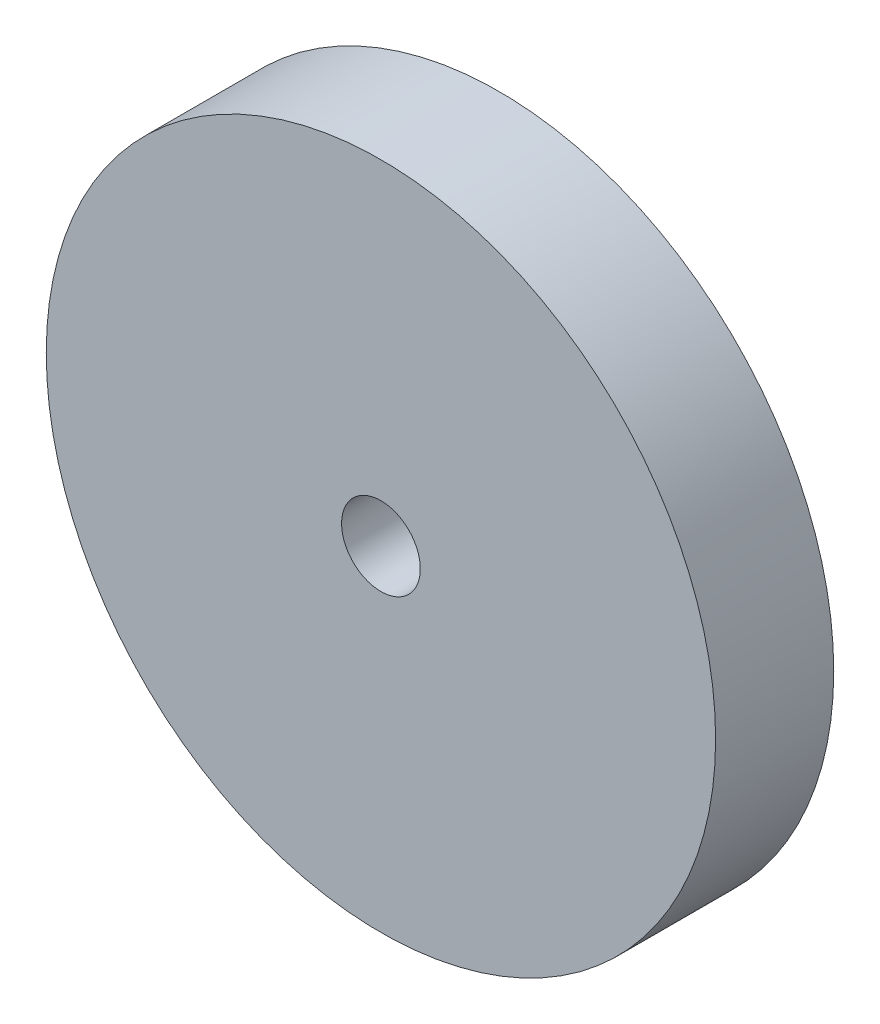
ISO-10303-21;
HEADER;
FILE_DESCRIPTION(('STEP AP214'),'2;1');
FILE_NAME('part.step','',(''),(''),'','','');
FILE_SCHEMA(('AUTOMOTIVE_DESIGN { 1 0 10303 214 1 1 1 1 }'));
ENDSEC;
DATA;
#1=APPLICATION_CONTEXT('core data for automotive mechanical design processes');
#2=APPLICATION_PROTOCOL_DEFINITION('international standard','automotive_design',2000,#1);
#3=PRODUCT_CONTEXT('',#1,'mechanical');
#4=PRODUCT('Part','Part','',(#3));
#5=PRODUCT_RELATED_PRODUCT_CATEGORY('part','',(#4));
#6=PRODUCT_DEFINITION_FORMATION('','',#4);
#7=PRODUCT_DEFINITION_CONTEXT('part definition',#1,'design');
#8=PRODUCT_DEFINITION('design','',#6,#7);
#9=PRODUCT_DEFINITION_SHAPE('','',#8);
#10=(LENGTH_UNIT() NAMED_UNIT(*) SI_UNIT(.MILLI.,.METRE.));
#11=(NAMED_UNIT(*) PLANE_ANGLE_UNIT() SI_UNIT($,.RADIAN.));
#12=(NAMED_UNIT(*) SI_UNIT($,.STERADIAN.) SOLID_ANGLE_UNIT());
#13=UNCERTAINTY_MEASURE_WITH_UNIT(LENGTH_MEASURE(1.E-05),#10,'distance_accuracy_value','');
#14=(GEOMETRIC_REPRESENTATION_CONTEXT(3) GLOBAL_UNCERTAINTY_ASSIGNED_CONTEXT((#13)) GLOBAL_UNIT_ASSIGNED_CONTEXT((#10,
#11,#12)) REPRESENTATION_CONTEXT('',''));
#15=CARTESIAN_POINT('',(0.,0.,0.));
#16=DIRECTION('',(0.,0.,1.));
#17=DIRECTION('',(1.,0.,0.));
#18=AXIS2_PLACEMENT_3D('',#15,#16,#17);
#19=CARTESIAN_POINT('',(0.,0.,0.));
#20=DIRECTION('',(0.,0.,1.));
#21=DIRECTION('',(1.,0.,0.));
#22=AXIS2_PLACEMENT_3D('',#19,#20,#21);
#23=PLANE('',#22);
#24=CARTESIAN_POINT('',(0.,0.,0.));
#25=DIRECTION('',(0.,0.,-1.));
#26=DIRECTION('',(-1.,0.,0.));
#27=AXIS2_PLACEMENT_3D('',#24,#25,#26);
#28=CIRCLE('',#27,1.);
#29=CARTESIAN_POINT('',(-1.,0.,0.));
#30=VERTEX_POINT('',#29);
#31=EDGE_CURVE('E26',#30,#30,#28,.F.);
#32=ORIENTED_EDGE('',*,*,#31,.T.);
#33=EDGE_LOOP('',(#32));
#34=FACE_BOUND('',#33,.T.);
#35=CARTESIAN_POINT('',(0.,0.,0.));
#36=DIRECTION('',(0.,0.,-1.));
#37=DIRECTION('',(-1.,0.,0.));
#38=AXIS2_PLACEMENT_3D('',#35,#36,#37);
#39=CIRCLE('',#38,8.5);
#40=CARTESIAN_POINT('',(-8.5,0.,0.));
#41=VERTEX_POINT('',#40);
#42=EDGE_CURVE('E17',#41,#41,#39,.F.);
#43=ORIENTED_EDGE('',*,*,#42,.F.);
#44=EDGE_LOOP('',(#43));
#45=FACE_BOUND('',#44,.T.);
#46=ADVANCED_FACE('F14',(#34,#45),#23,.F.);
#47=CARTESIAN_POINT('',(0.,0.,3.));
#48=DIRECTION('',(0.,0.,-1.));
#49=DIRECTION('',(-1.,0.,0.));
#50=AXIS2_PLACEMENT_3D('',#47,#48,#49);
#51=CYLINDRICAL_SURFACE('',#50,8.5);
#52=ORIENTED_EDGE('',*,*,#42,.T.);
#53=EDGE_LOOP('',(#52));
#54=FACE_BOUND('',#53,.T.);
#55=CARTESIAN_POINT('',(0.,0.,3.));
#56=DIRECTION('',(0.,0.,-1.));
#57=DIRECTION('',(-1.,0.,0.));
#58=AXIS2_PLACEMENT_3D('',#55,#56,#57);
#59=CIRCLE('',#58,8.5);
#60=CARTESIAN_POINT('',(-8.5,0.,3.));
#61=VERTEX_POINT('',#60);
#62=EDGE_CURVE('E21',#61,#61,#59,.F.);
#63=ORIENTED_EDGE('',*,*,#62,.F.);
#64=EDGE_LOOP('',(#63));
#65=FACE_BOUND('',#64,.T.);
#66=ADVANCED_FACE('F34',(#54,#65),#51,.T.);
#67=CARTESIAN_POINT('',(0.,0.,3.));
#68=DIRECTION('',(0.,0.,-1.));
#69=DIRECTION('',(-1.,0.,0.));
#70=AXIS2_PLACEMENT_3D('',#67,#68,#69);
#71=CYLINDRICAL_SURFACE('',#70,1.);
#72=CARTESIAN_POINT('',(0.,0.,3.));
#73=DIRECTION('',(0.,0.,-1.));
#74=DIRECTION('',(-1.,0.,0.));
#75=AXIS2_PLACEMENT_3D('',#72,#73,#74);
#76=CIRCLE('',#75,1.);
#77=CARTESIAN_POINT('',(-1.,0.,3.));
#78=VERTEX_POINT('',#77);
#79=EDGE_CURVE('E10',#78,#78,#76,.T.);
#80=ORIENTED_EDGE('',*,*,#79,.F.);
#81=EDGE_LOOP('',(#80));
#82=FACE_BOUND('',#81,.T.);
#83=ORIENTED_EDGE('',*,*,#31,.F.);
#84=EDGE_LOOP('',(#83));
#85=FACE_BOUND('',#84,.T.);
#86=ADVANCED_FACE('F42',(#82,#85),#71,.F.);
#87=CARTESIAN_POINT('',(0.,0.,3.));
#88=DIRECTION('',(0.,0.,1.));
#89=DIRECTION('',(1.,0.,0.));
#90=AXIS2_PLACEMENT_3D('',#87,#88,#89);
#91=PLANE('',#90);
#92=ORIENTED_EDGE('',*,*,#79,.T.);
#93=EDGE_LOOP('',(#92));
#94=FACE_BOUND('',#93,.T.);
#95=ORIENTED_EDGE('',*,*,#62,.T.);
#96=EDGE_LOOP('',(#95));
#97=FACE_BOUND('',#96,.T.);
#98=ADVANCED_FACE('F43',(#94,#97),#91,.T.);
#99=CLOSED_SHELL('',(#46,#66,#86,#98));
#100=MANIFOLD_SOLID_BREP('B1',#99);
#101=ADVANCED_BREP_SHAPE_REPRESENTATION('',(#18,#100),#14);
#102=SHAPE_DEFINITION_REPRESENTATION(#9,#101);
ENDSEC;
END-ISO-10303-21;
